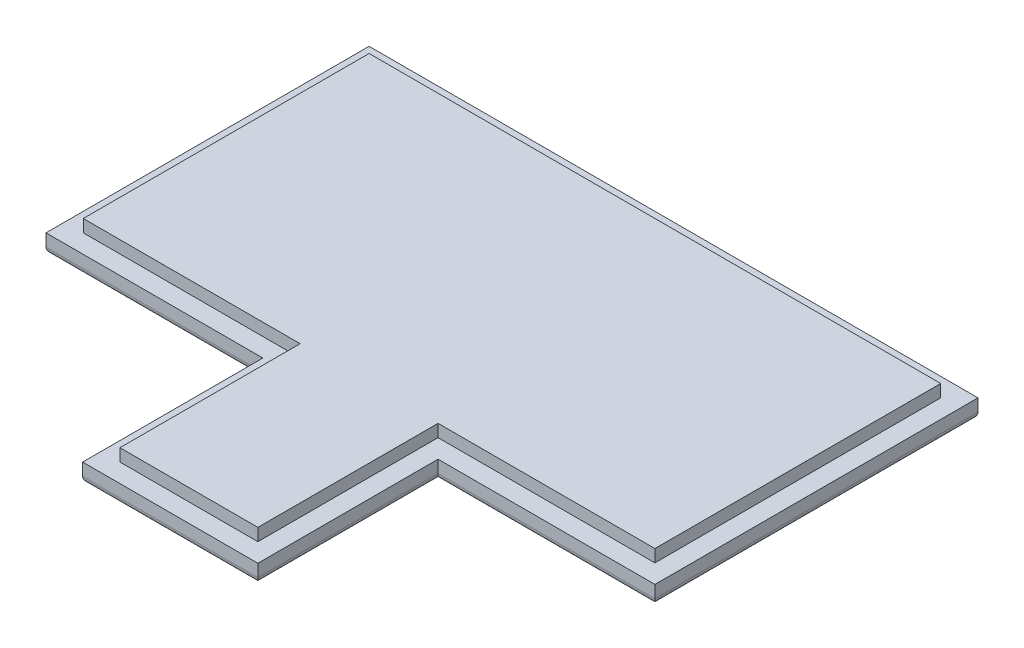
ISO-10303-21;
HEADER;
FILE_DESCRIPTION(('STEP AP214'),'2;1');
FILE_NAME('part.step','',(''),(''),'','','');
FILE_SCHEMA(('AUTOMOTIVE_DESIGN { 1 0 10303 214 1 1 1 1 }'));
ENDSEC;
DATA;
#1=APPLICATION_CONTEXT('core data for automotive mechanical design processes');
#2=APPLICATION_PROTOCOL_DEFINITION('international standard','automotive_design',2000,#1);
#3=PRODUCT_CONTEXT('',#1,'mechanical');
#4=PRODUCT('Part','Part','',(#3));
#5=PRODUCT_RELATED_PRODUCT_CATEGORY('part','',(#4));
#6=PRODUCT_DEFINITION_FORMATION('','',#4);
#7=PRODUCT_DEFINITION_CONTEXT('part definition',#1,'design');
#8=PRODUCT_DEFINITION('design','',#6,#7);
#9=PRODUCT_DEFINITION_SHAPE('','',#8);
#10=(LENGTH_UNIT() NAMED_UNIT(*) SI_UNIT(.MILLI.,.METRE.));
#11=(NAMED_UNIT(*) PLANE_ANGLE_UNIT() SI_UNIT($,.RADIAN.));
#12=(NAMED_UNIT(*) SI_UNIT($,.STERADIAN.) SOLID_ANGLE_UNIT());
#13=UNCERTAINTY_MEASURE_WITH_UNIT(LENGTH_MEASURE(1.E-05),#10,'distance_accuracy_value','');
#14=(GEOMETRIC_REPRESENTATION_CONTEXT(3) GLOBAL_UNCERTAINTY_ASSIGNED_CONTEXT((#13)) GLOBAL_UNIT_ASSIGNED_CONTEXT((#10,
#11,#12)) REPRESENTATION_CONTEXT('',''));
#15=CARTESIAN_POINT('',(0.,0.,0.));
#16=DIRECTION('',(0.,0.,1.));
#17=DIRECTION('',(1.,0.,0.));
#18=AXIS2_PLACEMENT_3D('',#15,#16,#17);
#19=CARTESIAN_POINT('',(0.,1.5,0.));
#20=DIRECTION('',(0.,-1.,0.));
#21=DIRECTION('',(0.,0.,-1.));
#22=AXIS2_PLACEMENT_3D('',#19,#20,#21);
#23=PLANE('',#22);
#24=DIRECTION('',(1.,0.,0.));
#25=VECTOR('',#24,1.);
#26=CARTESIAN_POINT('',(7.05,1.5,13.));
#27=LINE('',#26,#25);
#28=CARTESIAN_POINT('',(7.05,1.5,13.));
#29=VERTEX_POINT('',#28);
#30=CARTESIAN_POINT('',(24.5,1.5,13.));
#31=VERTEX_POINT('',#30);
#32=EDGE_CURVE('E204',#29,#31,#27,.T.);
#33=ORIENTED_EDGE('',*,*,#32,.T.);
#34=DIRECTION('',(0.,0.,-1.));
#35=VECTOR('',#34,1.);
#36=CARTESIAN_POINT('',(24.5,1.5,-13.));
#37=LINE('',#36,#35);
#38=CARTESIAN_POINT('',(24.5,1.5,-13.));
#39=VERTEX_POINT('',#38);
#40=EDGE_CURVE('E207',#31,#39,#37,.T.);
#41=ORIENTED_EDGE('',*,*,#40,.T.);
#42=DIRECTION('',(-1.,0.,0.));
#43=VECTOR('',#42,1.);
#44=CARTESIAN_POINT('',(-24.5,1.5,-13.));
#45=LINE('',#44,#43);
#46=CARTESIAN_POINT('',(-24.5,1.5,-13.));
#47=VERTEX_POINT('',#46);
#48=EDGE_CURVE('E214',#39,#47,#45,.T.);
#49=ORIENTED_EDGE('',*,*,#48,.T.);
#50=DIRECTION('',(0.,0.,1.));
#51=VECTOR('',#50,1.);
#52=CARTESIAN_POINT('',(-24.5,1.5,-13.));
#53=LINE('',#52,#51);
#54=CARTESIAN_POINT('',(-24.5,1.5,13.));
#55=VERTEX_POINT('',#54);
#56=EDGE_CURVE('E216',#47,#55,#53,.T.);
#57=ORIENTED_EDGE('',*,*,#56,.T.);
#58=DIRECTION('',(1.,0.,0.));
#59=VECTOR('',#58,1.);
#60=CARTESIAN_POINT('',(-24.5,1.5,13.));
#61=LINE('',#60,#59);
#62=CARTESIAN_POINT('',(-7.05,1.5,13.));
#63=VERTEX_POINT('',#62);
#64=EDGE_CURVE('E218',#55,#63,#61,.T.);
#65=ORIENTED_EDGE('',*,*,#64,.T.);
#66=DIRECTION('',(0.,0.,1.));
#67=VECTOR('',#66,1.);
#68=CARTESIAN_POINT('',(-7.05,1.5,13.));
#69=LINE('',#68,#67);
#70=CARTESIAN_POINT('',(-7.04999999999999,1.5,27.5));
#71=VERTEX_POINT('',#70);
#72=EDGE_CURVE('E220',#63,#71,#69,.T.);
#73=ORIENTED_EDGE('',*,*,#72,.T.);
#74=DIRECTION('',(1.,0.,0.));
#75=VECTOR('',#74,1.);
#76=CARTESIAN_POINT('',(-7.04999999999999,1.5,27.5));
#77=LINE('',#76,#75);
#78=CARTESIAN_POINT('',(7.05,1.5,27.5));
#79=VERTEX_POINT('',#78);
#80=EDGE_CURVE('E222',#71,#79,#77,.T.);
#81=ORIENTED_EDGE('',*,*,#80,.T.);
#82=DIRECTION('',(0.,0.,-1.));
#83=VECTOR('',#82,1.);
#84=CARTESIAN_POINT('',(7.05,1.5,27.5));
#85=LINE('',#84,#83);
#86=EDGE_CURVE('E224',#79,#29,#85,.T.);
#87=ORIENTED_EDGE('',*,*,#86,.T.);
#88=EDGE_LOOP('',(#33,#41,#49,#57,#65,#73,#81,#87));
#89=FACE_BOUND('',#88,.T.);
#90=DIRECTION('',(-1.,0.,0.));
#91=VECTOR('',#90,1.);
#92=CARTESIAN_POINT('',(-23.,1.5,-11.5));
#93=LINE('',#92,#91);
#94=CARTESIAN_POINT('',(23.,1.5,-11.5));
#95=VERTEX_POINT('',#94);
#96=CARTESIAN_POINT('',(-23.,1.5,-11.5));
#97=VERTEX_POINT('',#96);
#98=EDGE_CURVE('E203',#95,#97,#93,.T.);
#99=ORIENTED_EDGE('',*,*,#98,.F.);
#100=DIRECTION('',(0.,0.,-1.));
#101=VECTOR('',#100,1.);
#102=CARTESIAN_POINT('',(23.,1.5,-11.5));
#103=LINE('',#102,#101);
#104=CARTESIAN_POINT('',(23.,1.5,11.5));
#105=VERTEX_POINT('',#104);
#106=EDGE_CURVE('E200',#105,#95,#103,.T.);
#107=ORIENTED_EDGE('',*,*,#106,.F.);
#108=DIRECTION('',(1.,0.,0.));
#109=VECTOR('',#108,1.);
#110=CARTESIAN_POINT('',(5.55,1.5,11.5));
#111=LINE('',#110,#109);
#112=CARTESIAN_POINT('',(5.55,1.5,11.5));
#113=VERTEX_POINT('',#112);
#114=EDGE_CURVE('E320',#113,#105,#111,.T.);
#115=ORIENTED_EDGE('',*,*,#114,.F.);
#116=DIRECTION('',(0.,0.,-1.));
#117=VECTOR('',#116,1.);
#118=CARTESIAN_POINT('',(5.55,1.5,13.));
#119=LINE('',#118,#117);
#120=CARTESIAN_POINT('',(5.55000000000001,1.5,26.));
#121=VERTEX_POINT('',#120);
#122=EDGE_CURVE('E317',#121,#113,#119,.T.);
#123=ORIENTED_EDGE('',*,*,#122,.F.);
#124=DIRECTION('',(1.,0.,0.));
#125=VECTOR('',#124,1.);
#126=CARTESIAN_POINT('',(-5.55,1.5,26.));
#127=LINE('',#126,#125);
#128=CARTESIAN_POINT('',(-5.55,1.5,26.));
#129=VERTEX_POINT('',#128);
#130=EDGE_CURVE('E314',#129,#121,#127,.T.);
#131=ORIENTED_EDGE('',*,*,#130,.F.);
#132=DIRECTION('',(0.,0.,1.));
#133=VECTOR('',#132,1.);
#134=CARTESIAN_POINT('',(-5.54999999999999,1.5,24.5));
#135=LINE('',#134,#133);
#136=CARTESIAN_POINT('',(-5.55,1.5,11.5));
#137=VERTEX_POINT('',#136);
#138=EDGE_CURVE('E311',#137,#129,#135,.T.);
#139=ORIENTED_EDGE('',*,*,#138,.F.);
#140=DIRECTION('',(1.,0.,0.));
#141=VECTOR('',#140,1.);
#142=CARTESIAN_POINT('',(-23.,1.5,11.5));
#143=LINE('',#142,#141);
#144=CARTESIAN_POINT('',(-23.,1.5,11.5));
#145=VERTEX_POINT('',#144);
#146=EDGE_CURVE('E304',#145,#137,#143,.T.);
#147=ORIENTED_EDGE('',*,*,#146,.F.);
#148=DIRECTION('',(0.,0.,1.));
#149=VECTOR('',#148,1.);
#150=CARTESIAN_POINT('',(-23.,1.5,-11.5));
#151=LINE('',#150,#149);
#152=EDGE_CURVE('E302',#97,#145,#151,.T.);
#153=ORIENTED_EDGE('',*,*,#152,.F.);
#154=EDGE_LOOP('',(#99,#107,#115,#123,#131,#139,#147,#153));
#155=FACE_BOUND('',#154,.T.);
#156=ADVANCED_FACE('F39',(#89,#155),#23,.F.);
#157=CARTESIAN_POINT('',(7.05,1.5,13.));
#158=DIRECTION('',(0.,0.,-1.));
#159=DIRECTION('',(-1.,0.,0.));
#160=AXIS2_PLACEMENT_3D('',#157,#158,#159);
#161=PLANE('',#160);
#162=DIRECTION('',(0.,-1.,0.));
#163=VECTOR('',#162,1.);
#164=CARTESIAN_POINT('',(7.05,1.5,13.));
#165=LINE('',#164,#163);
#166=CARTESIAN_POINT('',(7.05,0.5,13.));
#167=VERTEX_POINT('',#166);
#168=EDGE_CURVE('E226',#29,#167,#165,.T.);
#169=ORIENTED_EDGE('',*,*,#168,.T.);
#170=DIRECTION('',(1.,0.,0.));
#171=VECTOR('',#170,1.);
#172=CARTESIAN_POINT('',(24.5,0.5,13.));
#173=LINE('',#172,#171);
#174=CARTESIAN_POINT('',(24.5,0.5,13.));
#175=VERTEX_POINT('',#174);
#176=EDGE_CURVE('E11',#167,#175,#173,.T.);
#177=ORIENTED_EDGE('',*,*,#176,.T.);
#178=DIRECTION('',(0.,-1.,0.));
#179=VECTOR('',#178,1.);
#180=CARTESIAN_POINT('',(24.5,1.5,13.));
#181=LINE('',#180,#179);
#182=EDGE_CURVE('E244',#31,#175,#181,.T.);
#183=ORIENTED_EDGE('',*,*,#182,.F.);
#184=ORIENTED_EDGE('',*,*,#32,.F.);
#185=EDGE_LOOP('',(#169,#177,#183,#184));
#186=FACE_BOUND('',#185,.T.);
#187=ADVANCED_FACE('F378',(#186),#161,.F.);
#188=CARTESIAN_POINT('',(24.5,1.5,-13.));
#189=DIRECTION('',(-1.,0.,0.));
#190=DIRECTION('',(0.,0.,1.));
#191=AXIS2_PLACEMENT_3D('',#188,#189,#190);
#192=PLANE('',#191);
#193=ORIENTED_EDGE('',*,*,#182,.T.);
#194=DIRECTION('',(0.,0.,-1.));
#195=VECTOR('',#194,1.);
#196=CARTESIAN_POINT('',(24.5,0.5,-13.));
#197=LINE('',#196,#195);
#198=CARTESIAN_POINT('',(24.5,0.5,-13.));
#199=VERTEX_POINT('',#198);
#200=EDGE_CURVE('E247',#175,#199,#197,.T.);
#201=ORIENTED_EDGE('',*,*,#200,.T.);
#202=DIRECTION('',(0.,-1.,0.));
#203=VECTOR('',#202,1.);
#204=CARTESIAN_POINT('',(24.5,1.5,-13.));
#205=LINE('',#204,#203);
#206=EDGE_CURVE('E241',#39,#199,#205,.T.);
#207=ORIENTED_EDGE('',*,*,#206,.F.);
#208=ORIENTED_EDGE('',*,*,#40,.F.);
#209=EDGE_LOOP('',(#193,#201,#207,#208));
#210=FACE_BOUND('',#209,.T.);
#211=ADVANCED_FACE('F384',(#210),#192,.F.);
#212=CARTESIAN_POINT('',(-24.5,1.5,-13.));
#213=DIRECTION('',(0.,0.,1.));
#214=DIRECTION('',(1.,0.,0.));
#215=AXIS2_PLACEMENT_3D('',#212,#213,#214);
#216=PLANE('',#215);
#217=ORIENTED_EDGE('',*,*,#206,.T.);
#218=DIRECTION('',(-1.,0.,0.));
#219=VECTOR('',#218,1.);
#220=CARTESIAN_POINT('',(-24.5,0.5,-13.));
#221=LINE('',#220,#219);
#222=CARTESIAN_POINT('',(-24.5,0.5,-13.));
#223=VERTEX_POINT('',#222);
#224=EDGE_CURVE('E267',#199,#223,#221,.T.);
#225=ORIENTED_EDGE('',*,*,#224,.T.);
#226=DIRECTION('',(0.,-1.,0.));
#227=VECTOR('',#226,1.);
#228=CARTESIAN_POINT('',(-24.5,1.5,-13.));
#229=LINE('',#228,#227);
#230=EDGE_CURVE('E238',#47,#223,#229,.T.);
#231=ORIENTED_EDGE('',*,*,#230,.F.);
#232=ORIENTED_EDGE('',*,*,#48,.F.);
#233=EDGE_LOOP('',(#217,#225,#231,#232));
#234=FACE_BOUND('',#233,.T.);
#235=ADVANCED_FACE('F411',(#234),#216,.F.);
#236=CARTESIAN_POINT('',(-24.5,1.5,-13.));
#237=DIRECTION('',(1.,0.,0.));
#238=DIRECTION('',(0.,0.,-1.));
#239=AXIS2_PLACEMENT_3D('',#236,#237,#238);
#240=PLANE('',#239);
#241=ORIENTED_EDGE('',*,*,#230,.T.);
#242=DIRECTION('',(0.,0.,1.));
#243=VECTOR('',#242,1.);
#244=CARTESIAN_POINT('',(-24.5,0.5,13.));
#245=LINE('',#244,#243);
#246=CARTESIAN_POINT('',(-24.5,0.5,13.));
#247=VERTEX_POINT('',#246);
#248=EDGE_CURVE('E269',#223,#247,#245,.T.);
#249=ORIENTED_EDGE('',*,*,#248,.T.);
#250=DIRECTION('',(0.,-1.,0.));
#251=VECTOR('',#250,1.);
#252=CARTESIAN_POINT('',(-24.5,1.5,13.));
#253=LINE('',#252,#251);
#254=EDGE_CURVE('E235',#55,#247,#253,.T.);
#255=ORIENTED_EDGE('',*,*,#254,.F.);
#256=ORIENTED_EDGE('',*,*,#56,.F.);
#257=EDGE_LOOP('',(#241,#249,#255,#256));
#258=FACE_BOUND('',#257,.T.);
#259=ADVANCED_FACE('F407',(#258),#240,.F.);
#260=CARTESIAN_POINT('',(-24.5,1.5,13.));
#261=DIRECTION('',(0.,0.,-1.));
#262=DIRECTION('',(-1.,0.,0.));
#263=AXIS2_PLACEMENT_3D('',#260,#261,#262);
#264=PLANE('',#263);
#265=ORIENTED_EDGE('',*,*,#254,.T.);
#266=DIRECTION('',(1.,0.,0.));
#267=VECTOR('',#266,1.);
#268=CARTESIAN_POINT('',(-7.05,0.5,13.));
#269=LINE('',#268,#267);
#270=CARTESIAN_POINT('',(-7.05,0.5,13.));
#271=VERTEX_POINT('',#270);
#272=EDGE_CURVE('E271',#247,#271,#269,.T.);
#273=ORIENTED_EDGE('',*,*,#272,.T.);
#274=DIRECTION('',(0.,-1.,0.));
#275=VECTOR('',#274,1.);
#276=CARTESIAN_POINT('',(-7.05,1.5,13.));
#277=LINE('',#276,#275);
#278=EDGE_CURVE('E232',#63,#271,#277,.T.);
#279=ORIENTED_EDGE('',*,*,#278,.F.);
#280=ORIENTED_EDGE('',*,*,#64,.F.);
#281=EDGE_LOOP('',(#265,#273,#279,#280));
#282=FACE_BOUND('',#281,.T.);
#283=ADVANCED_FACE('F403',(#282),#264,.F.);
#284=CARTESIAN_POINT('',(-7.04999999999999,1.5,26.));
#285=DIRECTION('',(1.,0.,0.));
#286=DIRECTION('',(0.,0.,-1.));
#287=AXIS2_PLACEMENT_3D('',#284,#285,#286);
#288=PLANE('',#287);
#289=ORIENTED_EDGE('',*,*,#278,.T.);
#290=DIRECTION('',(0.,0.,1.));
#291=VECTOR('',#290,1.);
#292=CARTESIAN_POINT('',(-7.04999999999999,0.5,27.5));
#293=LINE('',#292,#291);
#294=CARTESIAN_POINT('',(-7.04999999999999,0.5,27.5));
#295=VERTEX_POINT('',#294);
#296=EDGE_CURVE('E273',#271,#295,#293,.T.);
#297=ORIENTED_EDGE('',*,*,#296,.T.);
#298=DIRECTION('',(0.,-1.,0.));
#299=VECTOR('',#298,1.);
#300=CARTESIAN_POINT('',(-7.04999999999999,1.5,27.5));
#301=LINE('',#300,#299);
#302=EDGE_CURVE('E230',#71,#295,#301,.T.);
#303=ORIENTED_EDGE('',*,*,#302,.F.);
#304=ORIENTED_EDGE('',*,*,#72,.F.);
#305=EDGE_LOOP('',(#289,#297,#303,#304));
#306=FACE_BOUND('',#305,.T.);
#307=ADVANCED_FACE('F400',(#306),#288,.F.);
#308=CARTESIAN_POINT('',(-7.04999999999999,1.5,27.5));
#309=DIRECTION('',(0.,0.,-1.));
#310=DIRECTION('',(-1.,0.,0.));
#311=AXIS2_PLACEMENT_3D('',#308,#309,#310);
#312=PLANE('',#311);
#313=ORIENTED_EDGE('',*,*,#302,.T.);
#314=DIRECTION('',(1.,0.,0.));
#315=VECTOR('',#314,1.);
#316=CARTESIAN_POINT('',(7.05000000000001,0.5,27.5));
#317=LINE('',#316,#315);
#318=CARTESIAN_POINT('',(7.05,0.5,27.5));
#319=VERTEX_POINT('',#318);
#320=EDGE_CURVE('E63',#295,#319,#317,.T.);
#321=ORIENTED_EDGE('',*,*,#320,.T.);
#322=DIRECTION('',(0.,-1.,0.));
#323=VECTOR('',#322,1.);
#324=CARTESIAN_POINT('',(7.05,1.5,27.5));
#325=LINE('',#324,#323);
#326=EDGE_CURVE('E228',#79,#319,#325,.T.);
#327=ORIENTED_EDGE('',*,*,#326,.F.);
#328=ORIENTED_EDGE('',*,*,#80,.F.);
#329=EDGE_LOOP('',(#313,#321,#327,#328));
#330=FACE_BOUND('',#329,.T.);
#331=ADVANCED_FACE('F397',(#330),#312,.F.);
#332=CARTESIAN_POINT('',(7.05,1.5,26.));
#333=DIRECTION('',(-1.,0.,0.));
#334=DIRECTION('',(0.,0.,1.));
#335=AXIS2_PLACEMENT_3D('',#332,#333,#334);
#336=PLANE('',#335);
#337=ORIENTED_EDGE('',*,*,#326,.T.);
#338=DIRECTION('',(0.,0.,-1.));
#339=VECTOR('',#338,1.);
#340=CARTESIAN_POINT('',(7.05,0.5,13.));
#341=LINE('',#340,#339);
#342=EDGE_CURVE('E48',#319,#167,#341,.T.);
#343=ORIENTED_EDGE('',*,*,#342,.T.);
#344=ORIENTED_EDGE('',*,*,#168,.F.);
#345=ORIENTED_EDGE('',*,*,#86,.F.);
#346=EDGE_LOOP('',(#337,#343,#344,#345));
#347=FACE_BOUND('',#346,.T.);
#348=ADVANCED_FACE('F393',(#347),#336,.F.);
#349=CARTESIAN_POINT('',(0.,0.,0.));
#350=DIRECTION('',(0.,-1.,0.));
#351=DIRECTION('',(0.,0.,-1.));
#352=AXIS2_PLACEMENT_3D('',#349,#350,#351);
#353=PLANE('',#352);
#354=DIRECTION('',(-1.,0.,0.));
#355=VECTOR('',#354,1.);
#356=CARTESIAN_POINT('',(24.5,0.,-12.5));
#357=LINE('',#356,#355);
#358=CARTESIAN_POINT('',(-24.,0.,-12.5));
#359=VERTEX_POINT('',#358);
#360=CARTESIAN_POINT('',(24.,0.,-12.5));
#361=VERTEX_POINT('',#360);
#362=EDGE_CURVE('E262',#359,#361,#357,.F.);
#363=ORIENTED_EDGE('',*,*,#362,.T.);
#364=DIRECTION('',(0.,0.,-1.));
#365=VECTOR('',#364,1.);
#366=CARTESIAN_POINT('',(24.,0.,13.));
#367=LINE('',#366,#365);
#368=CARTESIAN_POINT('',(24.,0.,12.5));
#369=VERTEX_POINT('',#368);
#370=EDGE_CURVE('E264',#361,#369,#367,.F.);
#371=ORIENTED_EDGE('',*,*,#370,.T.);
#372=DIRECTION('',(1.,0.,0.));
#373=VECTOR('',#372,1.);
#374=CARTESIAN_POINT('',(7.05,0.,12.5));
#375=LINE('',#374,#373);
#376=CARTESIAN_POINT('',(6.55,0.,12.5));
#377=VERTEX_POINT('',#376);
#378=EDGE_CURVE('E250',#369,#377,#375,.F.);
#379=ORIENTED_EDGE('',*,*,#378,.T.);
#380=DIRECTION('',(0.,0.,-1.));
#381=VECTOR('',#380,1.);
#382=CARTESIAN_POINT('',(6.55,0.,27.5));
#383=LINE('',#382,#381);
#384=CARTESIAN_POINT('',(6.55,0.,27.));
#385=VERTEX_POINT('',#384);
#386=EDGE_CURVE('E252',#377,#385,#383,.F.);
#387=ORIENTED_EDGE('',*,*,#386,.T.);
#388=DIRECTION('',(1.,0.,0.));
#389=VECTOR('',#388,1.);
#390=CARTESIAN_POINT('',(-7.04999999999999,0.,27.));
#391=LINE('',#390,#389);
#392=CARTESIAN_POINT('',(-6.54999999999999,0.,27.));
#393=VERTEX_POINT('',#392);
#394=EDGE_CURVE('E254',#385,#393,#391,.F.);
#395=ORIENTED_EDGE('',*,*,#394,.T.);
#396=DIRECTION('',(0.,0.,1.));
#397=VECTOR('',#396,1.);
#398=CARTESIAN_POINT('',(-6.55,0.,13.));
#399=LINE('',#398,#397);
#400=CARTESIAN_POINT('',(-6.55,0.,12.5));
#401=VERTEX_POINT('',#400);
#402=EDGE_CURVE('E256',#393,#401,#399,.F.);
#403=ORIENTED_EDGE('',*,*,#402,.T.);
#404=DIRECTION('',(1.,0.,0.));
#405=VECTOR('',#404,1.);
#406=CARTESIAN_POINT('',(-24.5,0.,12.5));
#407=LINE('',#406,#405);
#408=CARTESIAN_POINT('',(-24.,0.,12.5));
#409=VERTEX_POINT('',#408);
#410=EDGE_CURVE('E258',#401,#409,#407,.F.);
#411=ORIENTED_EDGE('',*,*,#410,.T.);
#412=DIRECTION('',(0.,0.,1.));
#413=VECTOR('',#412,1.);
#414=CARTESIAN_POINT('',(-24.,0.,-13.));
#415=LINE('',#414,#413);
#416=EDGE_CURVE('E260',#409,#359,#415,.F.);
#417=ORIENTED_EDGE('',*,*,#416,.T.);
#418=EDGE_LOOP('',(#363,#371,#379,#387,#395,#403,#411,#417));
#419=FACE_BOUND('',#418,.T.);
#420=ADVANCED_FACE('F390',(#419),#353,.T.);
#421=CARTESIAN_POINT('',(-23.,2.5,-11.5));
#422=DIRECTION('',(0.,0.,1.));
#423=DIRECTION('',(1.,0.,0.));
#424=AXIS2_PLACEMENT_3D('',#421,#422,#423);
#425=PLANE('',#424);
#426=ORIENTED_EDGE('',*,*,#98,.T.);
#427=DIRECTION('',(0.,-1.,0.));
#428=VECTOR('',#427,1.);
#429=CARTESIAN_POINT('',(-23.,2.5,-11.5));
#430=LINE('',#429,#428);
#431=CARTESIAN_POINT('',(-23.,2.5,-11.5));
#432=VERTEX_POINT('',#431);
#433=EDGE_CURVE('E184',#432,#97,#430,.T.);
#434=ORIENTED_EDGE('',*,*,#433,.F.);
#435=DIRECTION('',(-1.,0.,0.));
#436=VECTOR('',#435,1.);
#437=CARTESIAN_POINT('',(-23.,2.5,-11.5));
#438=LINE('',#437,#436);
#439=CARTESIAN_POINT('',(23.,2.5,-11.5));
#440=VERTEX_POINT('',#439);
#441=EDGE_CURVE('E191',#440,#432,#438,.T.);
#442=ORIENTED_EDGE('',*,*,#441,.F.);
#443=DIRECTION('',(0.,-1.,0.));
#444=VECTOR('',#443,1.);
#445=CARTESIAN_POINT('',(23.,2.5,-11.5));
#446=LINE('',#445,#444);
#447=EDGE_CURVE('E325',#440,#95,#446,.T.);
#448=ORIENTED_EDGE('',*,*,#447,.T.);
#449=EDGE_LOOP('',(#426,#434,#442,#448));
#450=FACE_BOUND('',#449,.T.);
#451=ADVANCED_FACE('F202',(#450),#425,.F.);
#452=CARTESIAN_POINT('',(-23.,2.5,-11.5));
#453=DIRECTION('',(1.,0.,0.));
#454=DIRECTION('',(0.,0.,-1.));
#455=AXIS2_PLACEMENT_3D('',#452,#453,#454);
#456=PLANE('',#455);
#457=ORIENTED_EDGE('',*,*,#152,.T.);
#458=DIRECTION('',(0.,-1.,0.));
#459=VECTOR('',#458,1.);
#460=CARTESIAN_POINT('',(-23.,2.5,11.5));
#461=LINE('',#460,#459);
#462=CARTESIAN_POINT('',(-23.,2.5,11.5));
#463=VERTEX_POINT('',#462);
#464=EDGE_CURVE('E187',#463,#145,#461,.T.);
#465=ORIENTED_EDGE('',*,*,#464,.F.);
#466=DIRECTION('',(0.,0.,1.));
#467=VECTOR('',#466,1.);
#468=CARTESIAN_POINT('',(-23.,2.5,-11.5));
#469=LINE('',#468,#467);
#470=EDGE_CURVE('E179',#432,#463,#469,.T.);
#471=ORIENTED_EDGE('',*,*,#470,.F.);
#472=ORIENTED_EDGE('',*,*,#433,.T.);
#473=EDGE_LOOP('',(#457,#465,#471,#472));
#474=FACE_BOUND('',#473,.T.);
#475=ADVANCED_FACE('F182',(#474),#456,.F.);
#476=CARTESIAN_POINT('',(-23.,2.5,11.5));
#477=DIRECTION('',(0.,0.,-1.));
#478=DIRECTION('',(-1.,0.,0.));
#479=AXIS2_PLACEMENT_3D('',#476,#477,#478);
#480=PLANE('',#479);
#481=ORIENTED_EDGE('',*,*,#146,.T.);
#482=DIRECTION('',(0.,-1.,0.));
#483=VECTOR('',#482,1.);
#484=CARTESIAN_POINT('',(-5.55,2.5,11.5));
#485=LINE('',#484,#483);
#486=CARTESIAN_POINT('',(-5.55,2.5,11.5));
#487=VERTEX_POINT('',#486);
#488=EDGE_CURVE('E209',#487,#137,#485,.T.);
#489=ORIENTED_EDGE('',*,*,#488,.F.);
#490=DIRECTION('',(1.,0.,0.));
#491=VECTOR('',#490,1.);
#492=CARTESIAN_POINT('',(-23.,2.5,11.5));
#493=LINE('',#492,#491);
#494=EDGE_CURVE('E190',#463,#487,#493,.T.);
#495=ORIENTED_EDGE('',*,*,#494,.F.);
#496=ORIENTED_EDGE('',*,*,#464,.T.);
#497=EDGE_LOOP('',(#481,#489,#495,#496));
#498=FACE_BOUND('',#497,.T.);
#499=ADVANCED_FACE('F346',(#498),#480,.F.);
#500=CARTESIAN_POINT('',(-5.54999999999999,2.5,24.5));
#501=DIRECTION('',(1.,0.,0.));
#502=DIRECTION('',(0.,0.,-1.));
#503=AXIS2_PLACEMENT_3D('',#500,#501,#502);
#504=PLANE('',#503);
#505=ORIENTED_EDGE('',*,*,#138,.T.);
#506=DIRECTION('',(0.,-1.,0.));
#507=VECTOR('',#506,1.);
#508=CARTESIAN_POINT('',(-5.55,2.5,26.));
#509=LINE('',#508,#507);
#510=CARTESIAN_POINT('',(-5.55,2.5,26.));
#511=VERTEX_POINT('',#510);
#512=EDGE_CURVE('E336',#511,#129,#509,.T.);
#513=ORIENTED_EDGE('',*,*,#512,.F.);
#514=DIRECTION('',(0.,0.,1.));
#515=VECTOR('',#514,1.);
#516=CARTESIAN_POINT('',(-5.55,2.5,11.5));
#517=LINE('',#516,#515);
#518=EDGE_CURVE('E344',#487,#511,#517,.T.);
#519=ORIENTED_EDGE('',*,*,#518,.F.);
#520=ORIENTED_EDGE('',*,*,#488,.T.);
#521=EDGE_LOOP('',(#505,#513,#519,#520));
#522=FACE_BOUND('',#521,.T.);
#523=ADVANCED_FACE('F342',(#522),#504,.F.);
#524=CARTESIAN_POINT('',(-5.55,2.5,26.));
#525=DIRECTION('',(0.,0.,-1.));
#526=DIRECTION('',(-1.,0.,0.));
#527=AXIS2_PLACEMENT_3D('',#524,#525,#526);
#528=PLANE('',#527);
#529=ORIENTED_EDGE('',*,*,#130,.T.);
#530=DIRECTION('',(0.,-1.,0.));
#531=VECTOR('',#530,1.);
#532=CARTESIAN_POINT('',(5.55000000000001,2.5,26.));
#533=LINE('',#532,#531);
#534=CARTESIAN_POINT('',(5.55000000000001,2.5,26.));
#535=VERTEX_POINT('',#534);
#536=EDGE_CURVE('E333',#535,#121,#533,.T.);
#537=ORIENTED_EDGE('',*,*,#536,.F.);
#538=DIRECTION('',(1.,0.,0.));
#539=VECTOR('',#538,1.);
#540=CARTESIAN_POINT('',(-5.55,2.5,26.));
#541=LINE('',#540,#539);
#542=EDGE_CURVE('E359',#511,#535,#541,.T.);
#543=ORIENTED_EDGE('',*,*,#542,.F.);
#544=ORIENTED_EDGE('',*,*,#512,.T.);
#545=EDGE_LOOP('',(#529,#537,#543,#544));
#546=FACE_BOUND('',#545,.T.);
#547=ADVANCED_FACE('F350',(#546),#528,.F.);
#548=CARTESIAN_POINT('',(5.55,2.5,13.));
#549=DIRECTION('',(-1.,0.,0.));
#550=DIRECTION('',(0.,0.,1.));
#551=AXIS2_PLACEMENT_3D('',#548,#549,#550);
#552=PLANE('',#551);
#553=ORIENTED_EDGE('',*,*,#122,.T.);
#554=DIRECTION('',(0.,-1.,0.));
#555=VECTOR('',#554,1.);
#556=CARTESIAN_POINT('',(5.55,2.5,11.5));
#557=LINE('',#556,#555);
#558=CARTESIAN_POINT('',(5.55,2.5,11.5));
#559=VERTEX_POINT('',#558);
#560=EDGE_CURVE('E330',#559,#113,#557,.T.);
#561=ORIENTED_EDGE('',*,*,#560,.F.);
#562=DIRECTION('',(0.,0.,-1.));
#563=VECTOR('',#562,1.);
#564=CARTESIAN_POINT('',(5.55000000000001,2.5,26.));
#565=LINE('',#564,#563);
#566=EDGE_CURVE('E356',#535,#559,#565,.T.);
#567=ORIENTED_EDGE('',*,*,#566,.F.);
#568=ORIENTED_EDGE('',*,*,#536,.T.);
#569=EDGE_LOOP('',(#553,#561,#567,#568));
#570=FACE_BOUND('',#569,.T.);
#571=ADVANCED_FACE('F354',(#570),#552,.F.);
#572=CARTESIAN_POINT('',(5.55,2.5,11.5));
#573=DIRECTION('',(0.,0.,-1.));
#574=DIRECTION('',(-1.,0.,0.));
#575=AXIS2_PLACEMENT_3D('',#572,#573,#574);
#576=PLANE('',#575);
#577=ORIENTED_EDGE('',*,*,#114,.T.);
#578=DIRECTION('',(0.,-1.,0.));
#579=VECTOR('',#578,1.);
#580=CARTESIAN_POINT('',(23.,2.5,11.5));
#581=LINE('',#580,#579);
#582=CARTESIAN_POINT('',(23.,2.5,11.5));
#583=VERTEX_POINT('',#582);
#584=EDGE_CURVE('E327',#583,#105,#581,.T.);
#585=ORIENTED_EDGE('',*,*,#584,.F.);
#586=DIRECTION('',(1.,0.,0.));
#587=VECTOR('',#586,1.);
#588=CARTESIAN_POINT('',(5.55,2.5,11.5));
#589=LINE('',#588,#587);
#590=EDGE_CURVE('E358',#559,#583,#589,.T.);
#591=ORIENTED_EDGE('',*,*,#590,.F.);
#592=ORIENTED_EDGE('',*,*,#560,.T.);
#593=EDGE_LOOP('',(#577,#585,#591,#592));
#594=FACE_BOUND('',#593,.T.);
#595=ADVANCED_FACE('F366',(#594),#576,.F.);
#596=CARTESIAN_POINT('',(23.,2.5,-11.5));
#597=DIRECTION('',(-1.,0.,0.));
#598=DIRECTION('',(0.,0.,1.));
#599=AXIS2_PLACEMENT_3D('',#596,#597,#598);
#600=PLANE('',#599);
#601=ORIENTED_EDGE('',*,*,#106,.T.);
#602=ORIENTED_EDGE('',*,*,#447,.F.);
#603=DIRECTION('',(0.,0.,-1.));
#604=VECTOR('',#603,1.);
#605=CARTESIAN_POINT('',(23.,2.5,-11.5));
#606=LINE('',#605,#604);
#607=EDGE_CURVE('E196',#583,#440,#606,.T.);
#608=ORIENTED_EDGE('',*,*,#607,.F.);
#609=ORIENTED_EDGE('',*,*,#584,.T.);
#610=EDGE_LOOP('',(#601,#602,#608,#609));
#611=FACE_BOUND('',#610,.T.);
#612=ADVANCED_FACE('F368',(#611),#600,.F.);
#613=CARTESIAN_POINT('',(0.,2.5,0.));
#614=DIRECTION('',(0.,-1.,0.));
#615=DIRECTION('',(0.,0.,-1.));
#616=AXIS2_PLACEMENT_3D('',#613,#614,#615);
#617=PLANE('',#616);
#618=ORIENTED_EDGE('',*,*,#441,.T.);
#619=ORIENTED_EDGE('',*,*,#470,.T.);
#620=ORIENTED_EDGE('',*,*,#494,.T.);
#621=ORIENTED_EDGE('',*,*,#518,.T.);
#622=ORIENTED_EDGE('',*,*,#542,.T.);
#623=ORIENTED_EDGE('',*,*,#566,.T.);
#624=ORIENTED_EDGE('',*,*,#590,.T.);
#625=ORIENTED_EDGE('',*,*,#607,.T.);
#626=EDGE_LOOP('',(#618,#619,#620,#621,#622,#623,#624,#625));
#627=FACE_BOUND('',#626,.T.);
#628=ADVANCED_FACE('F194',(#627),#617,.F.);
#629=CARTESIAN_POINT('',(-6.54999999999999,0.5,26.));
#630=DIRECTION('',(0.,0.,-1.));
#631=DIRECTION('',(-1.,0.,0.));
#632=AXIS2_PLACEMENT_3D('',#629,#630,#631);
#633=CYLINDRICAL_SURFACE('',#632,0.5);
#634=CARTESIAN_POINT('',(-6.55,0.5,12.5));
#635=DIRECTION('',(-0.707106781186548,0.,-0.707106781186547));
#636=DIRECTION('',(-0.707106781186547,0.,0.707106781186548));
#637=AXIS2_PLACEMENT_3D('',#634,#635,#636);
#638=ELLIPSE('',#637,0.707106781186547,0.5);
#639=EDGE_CURVE('E292',#401,#271,#638,.T.);
#640=ORIENTED_EDGE('',*,*,#639,.F.);
#641=ORIENTED_EDGE('',*,*,#402,.F.);
#642=CARTESIAN_POINT('',(-6.54999999999999,0.5,27.));
#643=DIRECTION('',(-0.707106781186548,0.,-0.707106781186547));
#644=DIRECTION('',(-0.707106781186547,0.,0.707106781186548));
#645=AXIS2_PLACEMENT_3D('',#642,#643,#644);
#646=ELLIPSE('',#645,0.707106781186547,0.5);
#647=EDGE_CURVE('E43',#295,#393,#646,.F.);
#648=ORIENTED_EDGE('',*,*,#647,.F.);
#649=ORIENTED_EDGE('',*,*,#296,.F.);
#650=EDGE_LOOP('',(#640,#641,#648,#649));
#651=FACE_BOUND('',#650,.T.);
#652=ADVANCED_FACE('F41',(#651),#633,.T.);
#653=CARTESIAN_POINT('',(-7.04999999999999,0.5,27.));
#654=DIRECTION('',(-1.,0.,0.));
#655=DIRECTION('',(0.,0.,1.));
#656=AXIS2_PLACEMENT_3D('',#653,#654,#655);
#657=CYLINDRICAL_SURFACE('',#656,0.5);
#658=ORIENTED_EDGE('',*,*,#647,.T.);
#659=ORIENTED_EDGE('',*,*,#394,.F.);
#660=CARTESIAN_POINT('',(6.55,0.5,27.));
#661=DIRECTION('',(-0.707106781186547,0.,0.707106781186547));
#662=DIRECTION('',(0.707106781186547,0.,0.707106781186547));
#663=AXIS2_PLACEMENT_3D('',#660,#661,#662);
#664=ELLIPSE('',#663,0.707106781186547,0.5);
#665=EDGE_CURVE('E290',#319,#385,#664,.F.);
#666=ORIENTED_EDGE('',*,*,#665,.F.);
#667=ORIENTED_EDGE('',*,*,#320,.F.);
#668=EDGE_LOOP('',(#658,#659,#666,#667));
#669=FACE_BOUND('',#668,.T.);
#670=ADVANCED_FACE('F441',(#669),#657,.T.);
#671=CARTESIAN_POINT('',(-24.5,0.5,12.5));
#672=DIRECTION('',(-1.,0.,0.));
#673=DIRECTION('',(0.,0.,1.));
#674=AXIS2_PLACEMENT_3D('',#671,#672,#673);
#675=CYLINDRICAL_SURFACE('',#674,0.5);
#676=ORIENTED_EDGE('',*,*,#639,.T.);
#677=ORIENTED_EDGE('',*,*,#272,.F.);
#678=CARTESIAN_POINT('',(-24.,0.5,12.5));
#679=DIRECTION('',(-0.707106781186547,0.,-0.707106781186547));
#680=DIRECTION('',(-0.707106781186548,0.,0.707106781186547));
#681=AXIS2_PLACEMENT_3D('',#678,#679,#680);
#682=ELLIPSE('',#681,0.707106781186547,0.5);
#683=EDGE_CURVE('E287',#409,#247,#682,.T.);
#684=ORIENTED_EDGE('',*,*,#683,.F.);
#685=ORIENTED_EDGE('',*,*,#410,.F.);
#686=EDGE_LOOP('',(#676,#677,#684,#685));
#687=FACE_BOUND('',#686,.T.);
#688=ADVANCED_FACE('F438',(#687),#675,.T.);
#689=CARTESIAN_POINT('',(6.55,0.5,26.));
#690=DIRECTION('',(0.,0.,1.));
#691=DIRECTION('',(1.,0.,0.));
#692=AXIS2_PLACEMENT_3D('',#689,#690,#691);
#693=CYLINDRICAL_SURFACE('',#692,0.5);
#694=ORIENTED_EDGE('',*,*,#665,.T.);
#695=ORIENTED_EDGE('',*,*,#386,.F.);
#696=CARTESIAN_POINT('',(6.55,0.5,12.5));
#697=DIRECTION('',(-0.707106781186547,0.,0.707106781186547));
#698=DIRECTION('',(0.707106781186548,0.,0.707106781186547));
#699=AXIS2_PLACEMENT_3D('',#696,#697,#698);
#700=ELLIPSE('',#699,0.707106781186547,0.5);
#701=EDGE_CURVE('E284',#167,#377,#700,.F.);
#702=ORIENTED_EDGE('',*,*,#701,.F.);
#703=ORIENTED_EDGE('',*,*,#342,.F.);
#704=EDGE_LOOP('',(#694,#695,#702,#703));
#705=FACE_BOUND('',#704,.T.);
#706=ADVANCED_FACE('F434',(#705),#693,.T.);
#707=CARTESIAN_POINT('',(-24.,0.5,-13.));
#708=DIRECTION('',(0.,0.,-1.));
#709=DIRECTION('',(-1.,0.,0.));
#710=AXIS2_PLACEMENT_3D('',#707,#708,#709);
#711=CYLINDRICAL_SURFACE('',#710,0.5);
#712=ORIENTED_EDGE('',*,*,#683,.T.);
#713=ORIENTED_EDGE('',*,*,#248,.F.);
#714=CARTESIAN_POINT('',(-24.,0.5,-12.5));
#715=DIRECTION('',(0.707106781186547,0.,-0.707106781186547));
#716=DIRECTION('',(-0.707106781186547,0.,-0.707106781186547));
#717=AXIS2_PLACEMENT_3D('',#714,#715,#716);
#718=ELLIPSE('',#717,0.707106781186547,0.5);
#719=EDGE_CURVE('E281',#359,#223,#718,.T.);
#720=ORIENTED_EDGE('',*,*,#719,.F.);
#721=ORIENTED_EDGE('',*,*,#416,.F.);
#722=EDGE_LOOP('',(#712,#713,#720,#721));
#723=FACE_BOUND('',#722,.T.);
#724=ADVANCED_FACE('F430',(#723),#711,.T.);
#725=CARTESIAN_POINT('',(7.05,0.5,12.5));
#726=DIRECTION('',(-1.,0.,0.));
#727=DIRECTION('',(0.,0.,1.));
#728=AXIS2_PLACEMENT_3D('',#725,#726,#727);
#729=CYLINDRICAL_SURFACE('',#728,0.5);
#730=ORIENTED_EDGE('',*,*,#701,.T.);
#731=ORIENTED_EDGE('',*,*,#378,.F.);
#732=CARTESIAN_POINT('',(24.,0.5,12.5));
#733=DIRECTION('',(-0.707106781186547,0.,0.707106781186547));
#734=DIRECTION('',(-0.707106781186548,0.,-0.707106781186547));
#735=AXIS2_PLACEMENT_3D('',#732,#733,#734);
#736=ELLIPSE('',#735,0.707106781186547,0.5);
#737=EDGE_CURVE('E279',#175,#369,#736,.F.);
#738=ORIENTED_EDGE('',*,*,#737,.F.);
#739=ORIENTED_EDGE('',*,*,#176,.F.);
#740=EDGE_LOOP('',(#730,#731,#738,#739));
#741=FACE_BOUND('',#740,.T.);
#742=ADVANCED_FACE('F426',(#741),#729,.T.);
#743=CARTESIAN_POINT('',(-24.5,0.5,-12.5));
#744=DIRECTION('',(1.,0.,0.));
#745=DIRECTION('',(0.,0.,-1.));
#746=AXIS2_PLACEMENT_3D('',#743,#744,#745);
#747=CYLINDRICAL_SURFACE('',#746,0.5);
#748=ORIENTED_EDGE('',*,*,#719,.T.);
#749=ORIENTED_EDGE('',*,*,#224,.F.);
#750=CARTESIAN_POINT('',(24.,0.5,-12.5));
#751=DIRECTION('',(0.707106781186547,0.,0.707106781186547));
#752=DIRECTION('',(0.707106781186547,0.,-0.707106781186547));
#753=AXIS2_PLACEMENT_3D('',#750,#751,#752);
#754=ELLIPSE('',#753,0.707106781186547,0.5);
#755=EDGE_CURVE('E277',#361,#199,#754,.T.);
#756=ORIENTED_EDGE('',*,*,#755,.F.);
#757=ORIENTED_EDGE('',*,*,#362,.F.);
#758=EDGE_LOOP('',(#748,#749,#756,#757));
#759=FACE_BOUND('',#758,.T.);
#760=ADVANCED_FACE('F422',(#759),#747,.T.);
#761=CARTESIAN_POINT('',(24.,0.5,-13.));
#762=DIRECTION('',(0.,0.,1.));
#763=DIRECTION('',(1.,0.,0.));
#764=AXIS2_PLACEMENT_3D('',#761,#762,#763);
#765=CYLINDRICAL_SURFACE('',#764,0.5);
#766=ORIENTED_EDGE('',*,*,#737,.T.);
#767=ORIENTED_EDGE('',*,*,#370,.F.);
#768=ORIENTED_EDGE('',*,*,#755,.T.);
#769=ORIENTED_EDGE('',*,*,#200,.F.);
#770=EDGE_LOOP('',(#766,#767,#768,#769));
#771=FACE_BOUND('',#770,.T.);
#772=ADVANCED_FACE('F419',(#771),#765,.T.);
#773=CLOSED_SHELL('',(#156,#187,#211,#235,#259,#283,#307,#331,#348,#420,#451,#475,#499,#523,
#547,#571,#595,#612,#628,#652,#670,#688,#706,#724,#742,#760,#772));
#774=MANIFOLD_SOLID_BREP('B2',#773);
#775=ADVANCED_BREP_SHAPE_REPRESENTATION('',(#18,#774),#14);
#776=SHAPE_DEFINITION_REPRESENTATION(#9,#775);
ENDSEC;
END-ISO-10303-21;
